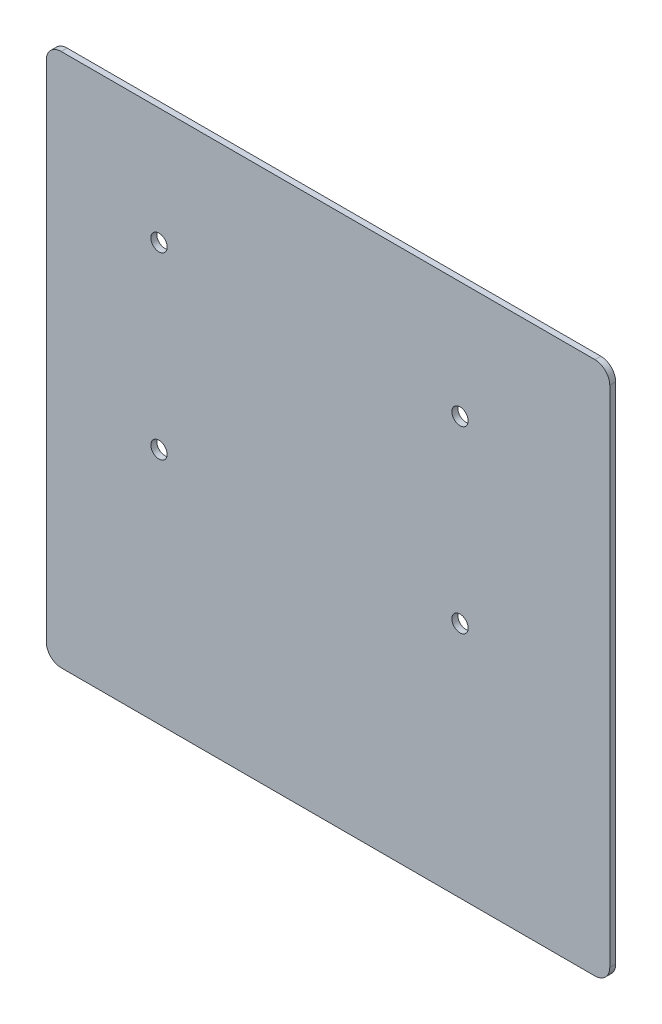
ISO-10303-21;
HEADER;
FILE_DESCRIPTION(('STEP AP214'),'2;1');
FILE_NAME('part.step','',(''),(''),'','','');
FILE_SCHEMA(('AUTOMOTIVE_DESIGN { 1 0 10303 214 1 1 1 1 }'));
ENDSEC;
DATA;
#1=APPLICATION_CONTEXT('core data for automotive mechanical design processes');
#2=APPLICATION_PROTOCOL_DEFINITION('international standard','automotive_design',2000,#1);
#3=PRODUCT_CONTEXT('',#1,'mechanical');
#4=PRODUCT('Part','Part','',(#3));
#5=PRODUCT_RELATED_PRODUCT_CATEGORY('part','',(#4));
#6=PRODUCT_DEFINITION_FORMATION('','',#4);
#7=PRODUCT_DEFINITION_CONTEXT('part definition',#1,'design');
#8=PRODUCT_DEFINITION('design','',#6,#7);
#9=PRODUCT_DEFINITION_SHAPE('','',#8);
#10=(LENGTH_UNIT() NAMED_UNIT(*) SI_UNIT(.MILLI.,.METRE.));
#11=(NAMED_UNIT(*) PLANE_ANGLE_UNIT() SI_UNIT($,.RADIAN.));
#12=(NAMED_UNIT(*) SI_UNIT($,.STERADIAN.) SOLID_ANGLE_UNIT());
#13=UNCERTAINTY_MEASURE_WITH_UNIT(LENGTH_MEASURE(1.E-05),#10,'distance_accuracy_value','');
#14=(GEOMETRIC_REPRESENTATION_CONTEXT(3) GLOBAL_UNCERTAINTY_ASSIGNED_CONTEXT((#13)) GLOBAL_UNIT_ASSIGNED_CONTEXT((#10,
#11,#12)) REPRESENTATION_CONTEXT('',''));
#15=CARTESIAN_POINT('',(0.,0.,0.));
#16=DIRECTION('',(0.,0.,1.));
#17=DIRECTION('',(1.,0.,0.));
#18=AXIS2_PLACEMENT_3D('',#15,#16,#17);
#19=CARTESIAN_POINT('',(350.,-30.,34.));
#20=DIRECTION('',(1.,0.,0.));
#21=DIRECTION('',(0.,0.,-1.));
#22=AXIS2_PLACEMENT_3D('',#19,#20,#21);
#23=PLANE('',#22);
#24=DIRECTION('',(0.,-1.,0.));
#25=VECTOR('',#24,1.);
#26=CARTESIAN_POINT('',(350.,-30.,34.));
#27=LINE('',#26,#25);
#28=CARTESIAN_POINT('',(350.,320.,34.));
#29=VERTEX_POINT('',#28);
#30=CARTESIAN_POINT('',(350.,-20.,34.));
#31=VERTEX_POINT('',#30);
#32=EDGE_CURVE('E127',#29,#31,#27,.T.);
#33=ORIENTED_EDGE('',*,*,#32,.F.);
#34=DIRECTION('',(0.,0.,-1.));
#35=VECTOR('',#34,1.);
#36=CARTESIAN_POINT('',(350.,320.,34.));
#37=LINE('',#36,#35);
#38=CARTESIAN_POINT('',(350.,320.,30.));
#39=VERTEX_POINT('',#38);
#40=EDGE_CURVE('E111',#29,#39,#37,.T.);
#41=ORIENTED_EDGE('',*,*,#40,.T.);
#42=DIRECTION('',(0.,-1.,0.));
#43=VECTOR('',#42,1.);
#44=CARTESIAN_POINT('',(350.,-30.,30.));
#45=LINE('',#44,#43);
#46=CARTESIAN_POINT('',(350.,-20.,30.));
#47=VERTEX_POINT('',#46);
#48=EDGE_CURVE('E124',#39,#47,#45,.T.);
#49=ORIENTED_EDGE('',*,*,#48,.T.);
#50=DIRECTION('',(0.,0.,-1.));
#51=VECTOR('',#50,1.);
#52=CARTESIAN_POINT('',(350.,-20.,34.));
#53=LINE('',#52,#51);
#54=EDGE_CURVE('E130',#47,#31,#53,.F.);
#55=ORIENTED_EDGE('',*,*,#54,.T.);
#56=EDGE_LOOP('',(#33,#41,#49,#55));
#57=FACE_BOUND('',#56,.T.);
#58=ADVANCED_FACE('F40',(#57),#23,.F.);
#59=CARTESIAN_POINT('',(350.,-30.,34.));
#60=DIRECTION('',(0.,1.,0.));
#61=DIRECTION('',(0.,0.,1.));
#62=AXIS2_PLACEMENT_3D('',#59,#60,#61);
#63=PLANE('',#62);
#64=DIRECTION('',(1.,0.,0.));
#65=VECTOR('',#64,1.);
#66=CARTESIAN_POINT('',(350.,-30.,30.));
#67=LINE('',#66,#65);
#68=CARTESIAN_POINT('',(360.,-30.,30.));
#69=VERTEX_POINT('',#68);
#70=CARTESIAN_POINT('',(720.,-30.,30.));
#71=VERTEX_POINT('',#70);
#72=EDGE_CURVE('E135',#69,#71,#67,.T.);
#73=ORIENTED_EDGE('',*,*,#72,.T.);
#74=DIRECTION('',(0.,0.,-1.));
#75=VECTOR('',#74,1.);
#76=CARTESIAN_POINT('',(720.,-30.,34.));
#77=LINE('',#76,#75);
#78=CARTESIAN_POINT('',(720.,-30.,34.));
#79=VERTEX_POINT('',#78);
#80=EDGE_CURVE('E11',#71,#79,#77,.F.);
#81=ORIENTED_EDGE('',*,*,#80,.T.);
#82=DIRECTION('',(1.,0.,0.));
#83=VECTOR('',#82,1.);
#84=CARTESIAN_POINT('',(350.,-30.,34.));
#85=LINE('',#84,#83);
#86=CARTESIAN_POINT('',(360.,-30.,34.));
#87=VERTEX_POINT('',#86);
#88=EDGE_CURVE('E195',#87,#79,#85,.T.);
#89=ORIENTED_EDGE('',*,*,#88,.F.);
#90=DIRECTION('',(0.,0.,-1.));
#91=VECTOR('',#90,1.);
#92=CARTESIAN_POINT('',(360.,-30.,34.));
#93=LINE('',#92,#91);
#94=EDGE_CURVE('E49',#87,#69,#93,.T.);
#95=ORIENTED_EDGE('',*,*,#94,.T.);
#96=EDGE_LOOP('',(#73,#81,#89,#95));
#97=FACE_BOUND('',#96,.T.);
#98=ADVANCED_FACE('F193',(#97),#63,.F.);
#99=CARTESIAN_POINT('',(730.,-30.,34.));
#100=DIRECTION('',(-1.,0.,0.));
#101=DIRECTION('',(0.,0.,1.));
#102=AXIS2_PLACEMENT_3D('',#99,#100,#101);
#103=PLANE('',#102);
#104=DIRECTION('',(0.,1.,0.));
#105=VECTOR('',#104,1.);
#106=CARTESIAN_POINT('',(730.,-30.,30.));
#107=LINE('',#106,#105);
#108=CARTESIAN_POINT('',(730.,-20.,30.));
#109=VERTEX_POINT('',#108);
#110=CARTESIAN_POINT('',(730.,320.,30.));
#111=VERTEX_POINT('',#110);
#112=EDGE_CURVE('E141',#109,#111,#107,.T.);
#113=ORIENTED_EDGE('',*,*,#112,.T.);
#114=DIRECTION('',(0.,0.,-1.));
#115=VECTOR('',#114,1.);
#116=CARTESIAN_POINT('',(730.,320.,34.));
#117=LINE('',#116,#115);
#118=CARTESIAN_POINT('',(730.,320.,34.));
#119=VERTEX_POINT('',#118);
#120=EDGE_CURVE('E56',#111,#119,#117,.F.);
#121=ORIENTED_EDGE('',*,*,#120,.T.);
#122=DIRECTION('',(0.,1.,0.));
#123=VECTOR('',#122,1.);
#124=CARTESIAN_POINT('',(730.,-30.,34.));
#125=LINE('',#124,#123);
#126=CARTESIAN_POINT('',(730.,-20.,34.));
#127=VERTEX_POINT('',#126);
#128=EDGE_CURVE('E203',#127,#119,#125,.T.);
#129=ORIENTED_EDGE('',*,*,#128,.F.);
#130=DIRECTION('',(0.,0.,-1.));
#131=VECTOR('',#130,1.);
#132=CARTESIAN_POINT('',(730.,-20.,34.));
#133=LINE('',#132,#131);
#134=EDGE_CURVE('E181',#127,#109,#133,.T.);
#135=ORIENTED_EDGE('',*,*,#134,.T.);
#136=EDGE_LOOP('',(#113,#121,#129,#135));
#137=FACE_BOUND('',#136,.T.);
#138=ADVANCED_FACE('F202',(#137),#103,.F.);
#139=CARTESIAN_POINT('',(350.,330.,34.));
#140=DIRECTION('',(0.,-1.,0.));
#141=DIRECTION('',(0.,0.,-1.));
#142=AXIS2_PLACEMENT_3D('',#139,#140,#141);
#143=PLANE('',#142);
#144=DIRECTION('',(-1.,0.,0.));
#145=VECTOR('',#144,1.);
#146=CARTESIAN_POINT('',(350.,330.,30.));
#147=LINE('',#146,#145);
#148=CARTESIAN_POINT('',(720.,330.,30.));
#149=VERTEX_POINT('',#148);
#150=CARTESIAN_POINT('',(360.,330.,30.));
#151=VERTEX_POINT('',#150);
#152=EDGE_CURVE('E153',#149,#151,#147,.T.);
#153=ORIENTED_EDGE('',*,*,#152,.T.);
#154=DIRECTION('',(0.,0.,-1.));
#155=VECTOR('',#154,1.);
#156=CARTESIAN_POINT('',(360.,330.,34.));
#157=LINE('',#156,#155);
#158=CARTESIAN_POINT('',(360.,330.,34.));
#159=VERTEX_POINT('',#158);
#160=EDGE_CURVE('E112',#151,#159,#157,.F.);
#161=ORIENTED_EDGE('',*,*,#160,.T.);
#162=DIRECTION('',(-1.,0.,0.));
#163=VECTOR('',#162,1.);
#164=CARTESIAN_POINT('',(350.,330.,34.));
#165=LINE('',#164,#163);
#166=CARTESIAN_POINT('',(720.,330.,34.));
#167=VERTEX_POINT('',#166);
#168=EDGE_CURVE('E148',#167,#159,#165,.T.);
#169=ORIENTED_EDGE('',*,*,#168,.F.);
#170=DIRECTION('',(0.,0.,-1.));
#171=VECTOR('',#170,1.);
#172=CARTESIAN_POINT('',(720.,330.,34.));
#173=LINE('',#172,#171);
#174=EDGE_CURVE('E118',#167,#149,#173,.T.);
#175=ORIENTED_EDGE('',*,*,#174,.T.);
#176=EDGE_LOOP('',(#153,#161,#169,#175));
#177=FACE_BOUND('',#176,.T.);
#178=ADVANCED_FACE('F247',(#177),#143,.F.);
#179=CARTESIAN_POINT('',(0.,0.,34.));
#180=DIRECTION('',(0.,0.,-1.));
#181=DIRECTION('',(-1.,0.,0.));
#182=AXIS2_PLACEMENT_3D('',#179,#180,#181);
#183=PLANE('',#182);
#184=CARTESIAN_POINT('',(426.000000000004,251.400000000022,34.));
#185=DIRECTION('',(0.,0.,1.));
#186=DIRECTION('',(1.,0.,0.));
#187=AXIS2_PLACEMENT_3D('',#184,#185,#186);
#188=CIRCLE('',#187,5.50000000000002);
#189=CARTESIAN_POINT('',(431.500000000004,251.400000000022,34.));
#190=VERTEX_POINT('',#189);
#191=EDGE_CURVE('E221',#190,#190,#188,.T.);
#192=ORIENTED_EDGE('',*,*,#191,.F.);
#193=EDGE_LOOP('',(#192));
#194=FACE_BOUND('',#193,.T.);
#195=CARTESIAN_POINT('',(426.000000000004,130.400000000022,34.));
#196=DIRECTION('',(0.,0.,1.));
#197=DIRECTION('',(1.,0.,0.));
#198=AXIS2_PLACEMENT_3D('',#195,#196,#197);
#199=CIRCLE('',#198,5.50000000000002);
#200=CARTESIAN_POINT('',(431.500000000004,130.400000000022,34.));
#201=VERTEX_POINT('',#200);
#202=EDGE_CURVE('E229',#201,#201,#199,.T.);
#203=ORIENTED_EDGE('',*,*,#202,.F.);
#204=EDGE_LOOP('',(#203));
#205=FACE_BOUND('',#204,.T.);
#206=CARTESIAN_POINT('',(629.000000000004,130.400000000022,34.));
#207=DIRECTION('',(0.,0.,1.));
#208=DIRECTION('',(1.,0.,0.));
#209=AXIS2_PLACEMENT_3D('',#206,#207,#208);
#210=CIRCLE('',#209,5.49999999999996);
#211=CARTESIAN_POINT('',(634.500000000004,130.400000000022,34.));
#212=VERTEX_POINT('',#211);
#213=EDGE_CURVE('E215',#212,#212,#210,.T.);
#214=ORIENTED_EDGE('',*,*,#213,.F.);
#215=EDGE_LOOP('',(#214));
#216=FACE_BOUND('',#215,.T.);
#217=CARTESIAN_POINT('',(629.000000000004,251.400000000022,34.));
#218=DIRECTION('',(0.,0.,1.));
#219=DIRECTION('',(1.,0.,0.));
#220=AXIS2_PLACEMENT_3D('',#217,#218,#219);
#221=CIRCLE('',#220,5.49999999999996);
#222=CARTESIAN_POINT('',(634.500000000004,251.400000000022,34.));
#223=VERTEX_POINT('',#222);
#224=EDGE_CURVE('E136',#223,#223,#221,.T.);
#225=ORIENTED_EDGE('',*,*,#224,.F.);
#226=EDGE_LOOP('',(#225));
#227=FACE_BOUND('',#226,.T.);
#228=ORIENTED_EDGE('',*,*,#168,.T.);
#229=CARTESIAN_POINT('',(360.,320.,34.));
#230=DIRECTION('',(0.,0.,-1.));
#231=DIRECTION('',(-1.,0.,0.));
#232=AXIS2_PLACEMENT_3D('',#229,#230,#231);
#233=CIRCLE('',#232,10.);
#234=EDGE_CURVE('E178',#159,#29,#233,.F.);
#235=ORIENTED_EDGE('',*,*,#234,.T.);
#236=ORIENTED_EDGE('',*,*,#32,.T.);
#237=CARTESIAN_POINT('',(360.,-20.,34.));
#238=DIRECTION('',(0.,0.,-1.));
#239=DIRECTION('',(-1.,0.,0.));
#240=AXIS2_PLACEMENT_3D('',#237,#238,#239);
#241=CIRCLE('',#240,10.);
#242=EDGE_CURVE('E170',#31,#87,#241,.F.);
#243=ORIENTED_EDGE('',*,*,#242,.T.);
#244=ORIENTED_EDGE('',*,*,#88,.T.);
#245=CARTESIAN_POINT('',(720.,-20.,34.));
#246=DIRECTION('',(0.,0.,-1.));
#247=DIRECTION('',(-1.,0.,0.));
#248=AXIS2_PLACEMENT_3D('',#245,#246,#247);
#249=CIRCLE('',#248,10.);
#250=EDGE_CURVE('E63',#79,#127,#249,.F.);
#251=ORIENTED_EDGE('',*,*,#250,.T.);
#252=ORIENTED_EDGE('',*,*,#128,.T.);
#253=CARTESIAN_POINT('',(720.,320.,34.));
#254=DIRECTION('',(0.,0.,-1.));
#255=DIRECTION('',(-1.,0.,0.));
#256=AXIS2_PLACEMENT_3D('',#253,#254,#255);
#257=CIRCLE('',#256,10.);
#258=EDGE_CURVE('E175',#119,#167,#257,.F.);
#259=ORIENTED_EDGE('',*,*,#258,.T.);
#260=EDGE_LOOP('',(#228,#235,#236,#243,#244,#251,#252,#259));
#261=FACE_BOUND('',#260,.T.);
#262=ADVANCED_FACE('F244',(#194,#205,#216,#227,#261),#183,.F.);
#263=CARTESIAN_POINT('',(0.,0.,30.));
#264=DIRECTION('',(0.,0.,-1.));
#265=DIRECTION('',(-1.,0.,0.));
#266=AXIS2_PLACEMENT_3D('',#263,#264,#265);
#267=PLANE('',#266);
#268=CARTESIAN_POINT('',(426.000000000004,251.400000000022,30.));
#269=DIRECTION('',(0.,0.,-1.));
#270=DIRECTION('',(-1.,0.,0.));
#271=AXIS2_PLACEMENT_3D('',#268,#269,#270);
#272=CIRCLE('',#271,5.50000000000002);
#273=CARTESIAN_POINT('',(420.500000000004,251.400000000022,30.));
#274=VERTEX_POINT('',#273);
#275=EDGE_CURVE('E217',#274,#274,#272,.F.);
#276=ORIENTED_EDGE('',*,*,#275,.T.);
#277=EDGE_LOOP('',(#276));
#278=FACE_BOUND('',#277,.T.);
#279=CARTESIAN_POINT('',(426.000000000004,130.400000000022,30.));
#280=DIRECTION('',(0.,0.,-1.));
#281=DIRECTION('',(-1.,0.,0.));
#282=AXIS2_PLACEMENT_3D('',#279,#280,#281);
#283=CIRCLE('',#282,5.50000000000002);
#284=CARTESIAN_POINT('',(420.500000000004,130.400000000022,30.));
#285=VERTEX_POINT('',#284);
#286=EDGE_CURVE('E225',#285,#285,#283,.F.);
#287=ORIENTED_EDGE('',*,*,#286,.T.);
#288=EDGE_LOOP('',(#287));
#289=FACE_BOUND('',#288,.T.);
#290=CARTESIAN_POINT('',(629.000000000004,130.400000000022,30.));
#291=DIRECTION('',(0.,0.,-1.));
#292=DIRECTION('',(-1.,0.,0.));
#293=AXIS2_PLACEMENT_3D('',#290,#291,#292);
#294=CIRCLE('',#293,5.49999999999996);
#295=CARTESIAN_POINT('',(623.500000000004,130.400000000022,30.));
#296=VERTEX_POINT('',#295);
#297=EDGE_CURVE('E233',#296,#296,#294,.F.);
#298=ORIENTED_EDGE('',*,*,#297,.T.);
#299=EDGE_LOOP('',(#298));
#300=FACE_BOUND('',#299,.T.);
#301=CARTESIAN_POINT('',(629.000000000004,251.400000000022,30.));
#302=DIRECTION('',(0.,0.,-1.));
#303=DIRECTION('',(-1.,0.,0.));
#304=AXIS2_PLACEMENT_3D('',#301,#302,#303);
#305=CIRCLE('',#304,5.49999999999996);
#306=CARTESIAN_POINT('',(623.500000000004,251.400000000022,30.));
#307=VERTEX_POINT('',#306);
#308=EDGE_CURVE('E145',#307,#307,#305,.F.);
#309=ORIENTED_EDGE('',*,*,#308,.T.);
#310=EDGE_LOOP('',(#309));
#311=FACE_BOUND('',#310,.T.);
#312=ORIENTED_EDGE('',*,*,#48,.F.);
#313=CARTESIAN_POINT('',(360.,320.,30.));
#314=DIRECTION('',(0.,0.,-1.));
#315=DIRECTION('',(-1.,0.,0.));
#316=AXIS2_PLACEMENT_3D('',#313,#314,#315);
#317=CIRCLE('',#316,10.);
#318=EDGE_CURVE('E107',#39,#151,#317,.T.);
#319=ORIENTED_EDGE('',*,*,#318,.T.);
#320=ORIENTED_EDGE('',*,*,#152,.F.);
#321=CARTESIAN_POINT('',(720.,320.,30.));
#322=DIRECTION('',(0.,0.,-1.));
#323=DIRECTION('',(-1.,0.,0.));
#324=AXIS2_PLACEMENT_3D('',#321,#322,#323);
#325=CIRCLE('',#324,10.);
#326=EDGE_CURVE('E119',#149,#111,#325,.T.);
#327=ORIENTED_EDGE('',*,*,#326,.T.);
#328=ORIENTED_EDGE('',*,*,#112,.F.);
#329=CARTESIAN_POINT('',(720.,-20.,30.));
#330=DIRECTION('',(0.,0.,-1.));
#331=DIRECTION('',(-1.,0.,0.));
#332=AXIS2_PLACEMENT_3D('',#329,#330,#331);
#333=CIRCLE('',#332,10.);
#334=EDGE_CURVE('E160',#109,#71,#333,.T.);
#335=ORIENTED_EDGE('',*,*,#334,.T.);
#336=ORIENTED_EDGE('',*,*,#72,.F.);
#337=CARTESIAN_POINT('',(360.,-20.,30.));
#338=DIRECTION('',(0.,0.,-1.));
#339=DIRECTION('',(-1.,0.,0.));
#340=AXIS2_PLACEMENT_3D('',#337,#338,#339);
#341=CIRCLE('',#340,10.);
#342=EDGE_CURVE('E129',#69,#47,#341,.T.);
#343=ORIENTED_EDGE('',*,*,#342,.T.);
#344=EDGE_LOOP('',(#312,#319,#320,#327,#328,#335,#336,#343));
#345=FACE_BOUND('',#344,.T.);
#346=ADVANCED_FACE('F132',(#278,#289,#300,#311,#345),#267,.T.);
#347=CARTESIAN_POINT('',(360.,320.,34.));
#348=DIRECTION('',(0.,0.,-1.));
#349=DIRECTION('',(-1.,0.,0.));
#350=AXIS2_PLACEMENT_3D('',#347,#348,#349);
#351=CYLINDRICAL_SURFACE('',#350,10.);
#352=ORIENTED_EDGE('',*,*,#234,.F.);
#353=ORIENTED_EDGE('',*,*,#160,.F.);
#354=ORIENTED_EDGE('',*,*,#318,.F.);
#355=ORIENTED_EDGE('',*,*,#40,.F.);
#356=EDGE_LOOP('',(#352,#353,#354,#355));
#357=FACE_BOUND('',#356,.T.);
#358=ADVANCED_FACE('F110',(#357),#351,.T.);
#359=CARTESIAN_POINT('',(720.,320.,34.));
#360=DIRECTION('',(0.,0.,-1.));
#361=DIRECTION('',(-1.,0.,0.));
#362=AXIS2_PLACEMENT_3D('',#359,#360,#361);
#363=CYLINDRICAL_SURFACE('',#362,10.);
#364=ORIENTED_EDGE('',*,*,#258,.F.);
#365=ORIENTED_EDGE('',*,*,#120,.F.);
#366=ORIENTED_EDGE('',*,*,#326,.F.);
#367=ORIENTED_EDGE('',*,*,#174,.F.);
#368=EDGE_LOOP('',(#364,#365,#366,#367));
#369=FACE_BOUND('',#368,.T.);
#370=ADVANCED_FACE('F255',(#369),#363,.T.);
#371=CARTESIAN_POINT('',(720.,-20.,34.));
#372=DIRECTION('',(0.,0.,-1.));
#373=DIRECTION('',(-1.,0.,0.));
#374=AXIS2_PLACEMENT_3D('',#371,#372,#373);
#375=CYLINDRICAL_SURFACE('',#374,10.);
#376=ORIENTED_EDGE('',*,*,#250,.F.);
#377=ORIENTED_EDGE('',*,*,#80,.F.);
#378=ORIENTED_EDGE('',*,*,#334,.F.);
#379=ORIENTED_EDGE('',*,*,#134,.F.);
#380=EDGE_LOOP('',(#376,#377,#378,#379));
#381=FACE_BOUND('',#380,.T.);
#382=ADVANCED_FACE('F201',(#381),#375,.T.);
#383=CARTESIAN_POINT('',(360.,-20.,34.));
#384=DIRECTION('',(0.,0.,-1.));
#385=DIRECTION('',(-1.,0.,0.));
#386=AXIS2_PLACEMENT_3D('',#383,#384,#385);
#387=CYLINDRICAL_SURFACE('',#386,10.);
#388=ORIENTED_EDGE('',*,*,#242,.F.);
#389=ORIENTED_EDGE('',*,*,#54,.F.);
#390=ORIENTED_EDGE('',*,*,#342,.F.);
#391=ORIENTED_EDGE('',*,*,#94,.F.);
#392=EDGE_LOOP('',(#388,#389,#390,#391));
#393=FACE_BOUND('',#392,.T.);
#394=ADVANCED_FACE('F42',(#393),#387,.T.);
#395=CARTESIAN_POINT('',(629.000000000004,251.400000000022,-30.0010000000001));
#396=DIRECTION('',(0.,0.,1.));
#397=DIRECTION('',(1.,0.,0.));
#398=AXIS2_PLACEMENT_3D('',#395,#396,#397);
#399=CYLINDRICAL_SURFACE('',#398,5.49999999999996);
#400=ORIENTED_EDGE('',*,*,#308,.F.);
#401=EDGE_LOOP('',(#400));
#402=FACE_BOUND('',#401,.T.);
#403=ORIENTED_EDGE('',*,*,#224,.T.);
#404=EDGE_LOOP('',(#403));
#405=FACE_BOUND('',#404,.T.);
#406=ADVANCED_FACE('F277',(#402,#405),#399,.F.);
#407=CARTESIAN_POINT('',(629.000000000004,130.400000000022,-30.0010000000001));
#408=DIRECTION('',(0.,0.,1.));
#409=DIRECTION('',(1.,0.,0.));
#410=AXIS2_PLACEMENT_3D('',#407,#408,#409);
#411=CYLINDRICAL_SURFACE('',#410,5.49999999999996);
#412=ORIENTED_EDGE('',*,*,#297,.F.);
#413=EDGE_LOOP('',(#412));
#414=FACE_BOUND('',#413,.T.);
#415=ORIENTED_EDGE('',*,*,#213,.T.);
#416=EDGE_LOOP('',(#415));
#417=FACE_BOUND('',#416,.T.);
#418=ADVANCED_FACE('F242',(#414,#417),#411,.F.);
#419=CARTESIAN_POINT('',(426.000000000004,130.400000000022,-30.0010000000001));
#420=DIRECTION('',(0.,0.,1.));
#421=DIRECTION('',(1.,0.,0.));
#422=AXIS2_PLACEMENT_3D('',#419,#420,#421);
#423=CYLINDRICAL_SURFACE('',#422,5.50000000000002);
#424=ORIENTED_EDGE('',*,*,#286,.F.);
#425=EDGE_LOOP('',(#424));
#426=FACE_BOUND('',#425,.T.);
#427=ORIENTED_EDGE('',*,*,#202,.T.);
#428=EDGE_LOOP('',(#427));
#429=FACE_BOUND('',#428,.T.);
#430=ADVANCED_FACE('F284',(#426,#429),#423,.F.);
#431=CARTESIAN_POINT('',(426.000000000004,251.400000000022,-30.0010000000001));
#432=DIRECTION('',(0.,0.,1.));
#433=DIRECTION('',(1.,0.,0.));
#434=AXIS2_PLACEMENT_3D('',#431,#432,#433);
#435=CYLINDRICAL_SURFACE('',#434,5.50000000000002);
#436=ORIENTED_EDGE('',*,*,#275,.F.);
#437=EDGE_LOOP('',(#436));
#438=FACE_BOUND('',#437,.T.);
#439=ORIENTED_EDGE('',*,*,#191,.T.);
#440=EDGE_LOOP('',(#439));
#441=FACE_BOUND('',#440,.T.);
#442=ADVANCED_FACE('F281',(#438,#441),#435,.F.);
#443=CLOSED_SHELL('',(#58,#98,#138,#178,#262,#346,#358,#370,#382,#394,#406,#418,#430,#442));
#444=MANIFOLD_SOLID_BREP('B2',#443);
#445=ADVANCED_BREP_SHAPE_REPRESENTATION('',(#18,#444),#14);
#446=SHAPE_DEFINITION_REPRESENTATION(#9,#445);
ENDSEC;
END-ISO-10303-21;
